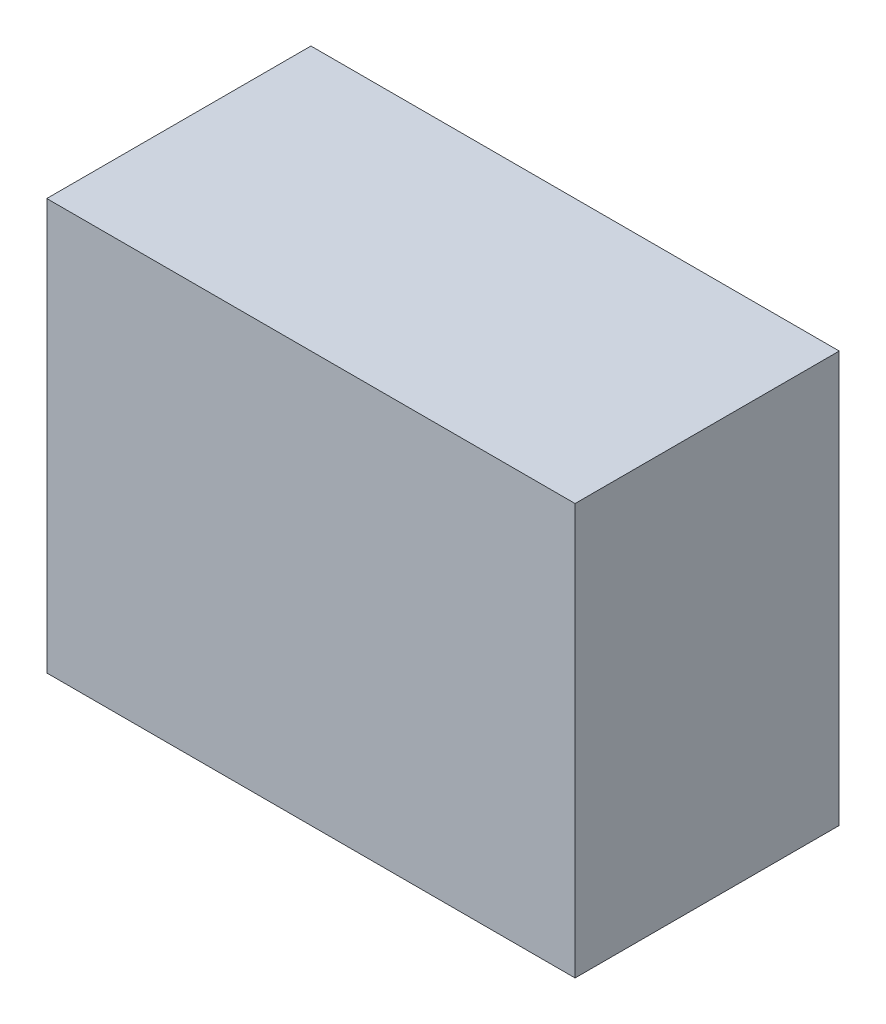
ISO-10303-21;
HEADER;
FILE_DESCRIPTION(('STEP AP214'),'2;1');
FILE_NAME('part.step','',(''),(''),'','','');
FILE_SCHEMA(('AUTOMOTIVE_DESIGN { 1 0 10303 214 1 1 1 1 }'));
ENDSEC;
DATA;
#1=APPLICATION_CONTEXT('core data for automotive mechanical design processes');
#2=APPLICATION_PROTOCOL_DEFINITION('international standard','automotive_design',2000,#1);
#3=PRODUCT_CONTEXT('',#1,'mechanical');
#4=PRODUCT('Part','Part','',(#3));
#5=PRODUCT_RELATED_PRODUCT_CATEGORY('part','',(#4));
#6=PRODUCT_DEFINITION_FORMATION('','',#4);
#7=PRODUCT_DEFINITION_CONTEXT('part definition',#1,'design');
#8=PRODUCT_DEFINITION('design','',#6,#7);
#9=PRODUCT_DEFINITION_SHAPE('','',#8);
#10=(LENGTH_UNIT() NAMED_UNIT(*) SI_UNIT(.MILLI.,.METRE.));
#11=(NAMED_UNIT(*) PLANE_ANGLE_UNIT() SI_UNIT($,.RADIAN.));
#12=(NAMED_UNIT(*) SI_UNIT($,.STERADIAN.) SOLID_ANGLE_UNIT());
#13=UNCERTAINTY_MEASURE_WITH_UNIT(LENGTH_MEASURE(1.E-05),#10,'distance_accuracy_value','');
#14=(GEOMETRIC_REPRESENTATION_CONTEXT(3) GLOBAL_UNCERTAINTY_ASSIGNED_CONTEXT((#13)) GLOBAL_UNIT_ASSIGNED_CONTEXT((#10,
#11,#12)) REPRESENTATION_CONTEXT('',''));
#15=CARTESIAN_POINT('',(0.,0.,0.));
#16=DIRECTION('',(0.,0.,1.));
#17=DIRECTION('',(1.,0.,0.));
#18=AXIS2_PLACEMENT_3D('',#15,#16,#17);
#19=CARTESIAN_POINT('',(-1.79999894,-1.39999974,1.79999894));
#20=DIRECTION('',(0.,0.,1.));
#21=DIRECTION('',(1.,0.,0.));
#22=AXIS2_PLACEMENT_3D('',#19,#20,#21);
#23=PLANE('',#22);
#24=DIRECTION('',(1.,0.,0.));
#25=VECTOR('',#24,1.);
#26=CARTESIAN_POINT('',(-1.79999894,1.39999974,1.79999894));
#27=LINE('',#26,#25);
#28=CARTESIAN_POINT('',(-1.79999894,1.39999974,1.79999894));
#29=VERTEX_POINT('',#28);
#30=CARTESIAN_POINT('',(1.80000148,1.39999974,1.79999894));
#31=VERTEX_POINT('',#30);
#32=EDGE_CURVE('E53',#29,#31,#27,.T.);
#33=ORIENTED_EDGE('',*,*,#32,.F.);
#34=DIRECTION('',(0.,1.,0.));
#35=VECTOR('',#34,1.);
#36=CARTESIAN_POINT('',(-1.79999894,-1.39999974,1.79999894));
#37=LINE('',#36,#35);
#38=CARTESIAN_POINT('',(-1.79999894,-1.39999974,1.79999894));
#39=VERTEX_POINT('',#38);
#40=EDGE_CURVE('E68',#39,#29,#37,.T.);
#41=ORIENTED_EDGE('',*,*,#40,.F.);
#42=DIRECTION('',(1.,0.,0.));
#43=VECTOR('',#42,1.);
#44=CARTESIAN_POINT('',(1.80000148,-1.39999974,1.79999894));
#45=LINE('',#44,#43);
#46=CARTESIAN_POINT('',(1.80000148,-1.39999974,1.79999894));
#47=VERTEX_POINT('',#46);
#48=EDGE_CURVE('E20',#47,#39,#45,.F.);
#49=ORIENTED_EDGE('',*,*,#48,.F.);
#50=DIRECTION('',(0.,1.,0.));
#51=VECTOR('',#50,1.);
#52=CARTESIAN_POINT('',(1.80000148,1.39999974,1.79999894));
#53=LINE('',#52,#51);
#54=EDGE_CURVE('E58',#31,#47,#53,.F.);
#55=ORIENTED_EDGE('',*,*,#54,.F.);
#56=EDGE_LOOP('',(#33,#41,#49,#55));
#57=FACE_BOUND('',#56,.T.);
#58=ADVANCED_FACE('F17',(#57),#23,.T.);
#59=CARTESIAN_POINT('',(1.80000148,-1.39999974,0.));
#60=DIRECTION('',(0.,-1.,0.));
#61=DIRECTION('',(0.,0.,-1.));
#62=AXIS2_PLACEMENT_3D('',#59,#60,#61);
#63=PLANE('',#62);
#64=DIRECTION('',(0.,0.,1.));
#65=VECTOR('',#64,1.);
#66=CARTESIAN_POINT('',(-1.79999894,-1.39999974,0.));
#67=LINE('',#66,#65);
#68=CARTESIAN_POINT('',(-1.79999894,-1.39999974,0.));
#69=VERTEX_POINT('',#68);
#70=EDGE_CURVE('E79',#69,#39,#67,.T.);
#71=ORIENTED_EDGE('',*,*,#70,.F.);
#72=DIRECTION('',(1.,0.,0.));
#73=VECTOR('',#72,1.);
#74=CARTESIAN_POINT('',(-1.79999894,-1.39999974,0.));
#75=LINE('',#74,#73);
#76=CARTESIAN_POINT('',(1.80000148,-1.39999974,0.));
#77=VERTEX_POINT('',#76);
#78=EDGE_CURVE('E74',#69,#77,#75,.T.);
#79=ORIENTED_EDGE('',*,*,#78,.T.);
#80=DIRECTION('',(0.,0.,-1.));
#81=VECTOR('',#80,1.);
#82=CARTESIAN_POINT('',(1.80000148,-1.39999974,0.));
#83=LINE('',#82,#81);
#84=EDGE_CURVE('E63',#47,#77,#83,.T.);
#85=ORIENTED_EDGE('',*,*,#84,.F.);
#86=ORIENTED_EDGE('',*,*,#48,.T.);
#87=EDGE_LOOP('',(#71,#79,#85,#86));
#88=FACE_BOUND('',#87,.T.);
#89=ADVANCED_FACE('F73',(#88),#63,.T.);
#90=CARTESIAN_POINT('',(1.80000148,1.39999974,0.));
#91=DIRECTION('',(1.,0.,0.));
#92=DIRECTION('',(0.,0.,-1.));
#93=AXIS2_PLACEMENT_3D('',#90,#91,#92);
#94=PLANE('',#93);
#95=ORIENTED_EDGE('',*,*,#84,.T.);
#96=DIRECTION('',(0.,1.,0.));
#97=VECTOR('',#96,1.);
#98=CARTESIAN_POINT('',(1.80000148,-1.39999974,0.));
#99=LINE('',#98,#97);
#100=CARTESIAN_POINT('',(1.80000148,1.39999974,0.));
#101=VERTEX_POINT('',#100);
#102=EDGE_CURVE('E84',#77,#101,#99,.T.);
#103=ORIENTED_EDGE('',*,*,#102,.T.);
#104=DIRECTION('',(0.,0.,1.));
#105=VECTOR('',#104,1.);
#106=CARTESIAN_POINT('',(1.80000148,1.39999974,0.));
#107=LINE('',#106,#105);
#108=EDGE_CURVE('E65',#31,#101,#107,.F.);
#109=ORIENTED_EDGE('',*,*,#108,.F.);
#110=ORIENTED_EDGE('',*,*,#54,.T.);
#111=EDGE_LOOP('',(#95,#103,#109,#110));
#112=FACE_BOUND('',#111,.T.);
#113=ADVANCED_FACE('F60',(#112),#94,.T.);
#114=CARTESIAN_POINT('',(-1.79999894,1.39999974,0.));
#115=DIRECTION('',(0.,1.,0.));
#116=DIRECTION('',(0.,0.,1.));
#117=AXIS2_PLACEMENT_3D('',#114,#115,#116);
#118=PLANE('',#117);
#119=ORIENTED_EDGE('',*,*,#108,.T.);
#120=DIRECTION('',(1.,0.,0.));
#121=VECTOR('',#120,1.);
#122=CARTESIAN_POINT('',(-1.79999894,1.39999974,0.));
#123=LINE('',#122,#121);
#124=CARTESIAN_POINT('',(-1.79999894,1.39999974,0.));
#125=VERTEX_POINT('',#124);
#126=EDGE_CURVE('E26',#101,#125,#123,.F.);
#127=ORIENTED_EDGE('',*,*,#126,.T.);
#128=DIRECTION('',(0.,0.,1.));
#129=VECTOR('',#128,1.);
#130=CARTESIAN_POINT('',(-1.79999894,1.39999974,0.));
#131=LINE('',#130,#129);
#132=EDGE_CURVE('E34',#29,#125,#131,.F.);
#133=ORIENTED_EDGE('',*,*,#132,.F.);
#134=ORIENTED_EDGE('',*,*,#32,.T.);
#135=EDGE_LOOP('',(#119,#127,#133,#134));
#136=FACE_BOUND('',#135,.T.);
#137=ADVANCED_FACE('F88',(#136),#118,.T.);
#138=CARTESIAN_POINT('',(-1.79999894,-1.39999974,0.));
#139=DIRECTION('',(-1.,0.,0.));
#140=DIRECTION('',(0.,0.,1.));
#141=AXIS2_PLACEMENT_3D('',#138,#139,#140);
#142=PLANE('',#141);
#143=ORIENTED_EDGE('',*,*,#132,.T.);
#144=DIRECTION('',(0.,1.,0.));
#145=VECTOR('',#144,1.);
#146=CARTESIAN_POINT('',(-1.79999894,-1.39999974,0.));
#147=LINE('',#146,#145);
#148=EDGE_CURVE('E11',#125,#69,#147,.F.);
#149=ORIENTED_EDGE('',*,*,#148,.T.);
#150=ORIENTED_EDGE('',*,*,#70,.T.);
#151=ORIENTED_EDGE('',*,*,#40,.T.);
#152=EDGE_LOOP('',(#143,#149,#150,#151));
#153=FACE_BOUND('',#152,.T.);
#154=ADVANCED_FACE('F91',(#153),#142,.T.);
#155=CARTESIAN_POINT('',(-1.79999894,-1.39999974,0.));
#156=DIRECTION('',(0.,0.,1.));
#157=DIRECTION('',(1.,0.,0.));
#158=AXIS2_PLACEMENT_3D('',#155,#156,#157);
#159=PLANE('',#158);
#160=ORIENTED_EDGE('',*,*,#126,.F.);
#161=ORIENTED_EDGE('',*,*,#102,.F.);
#162=ORIENTED_EDGE('',*,*,#78,.F.);
#163=ORIENTED_EDGE('',*,*,#148,.F.);
#164=EDGE_LOOP('',(#160,#161,#162,#163));
#165=FACE_BOUND('',#164,.T.);
#166=ADVANCED_FACE('F90',(#165),#159,.F.);
#167=CLOSED_SHELL('',(#58,#89,#113,#137,#154,#166));
#168=MANIFOLD_SOLID_BREP('B1',#167);
#169=ADVANCED_BREP_SHAPE_REPRESENTATION('',(#18,#168),#14);
#170=SHAPE_DEFINITION_REPRESENTATION(#9,#169);
ENDSEC;
END-ISO-10303-21;
